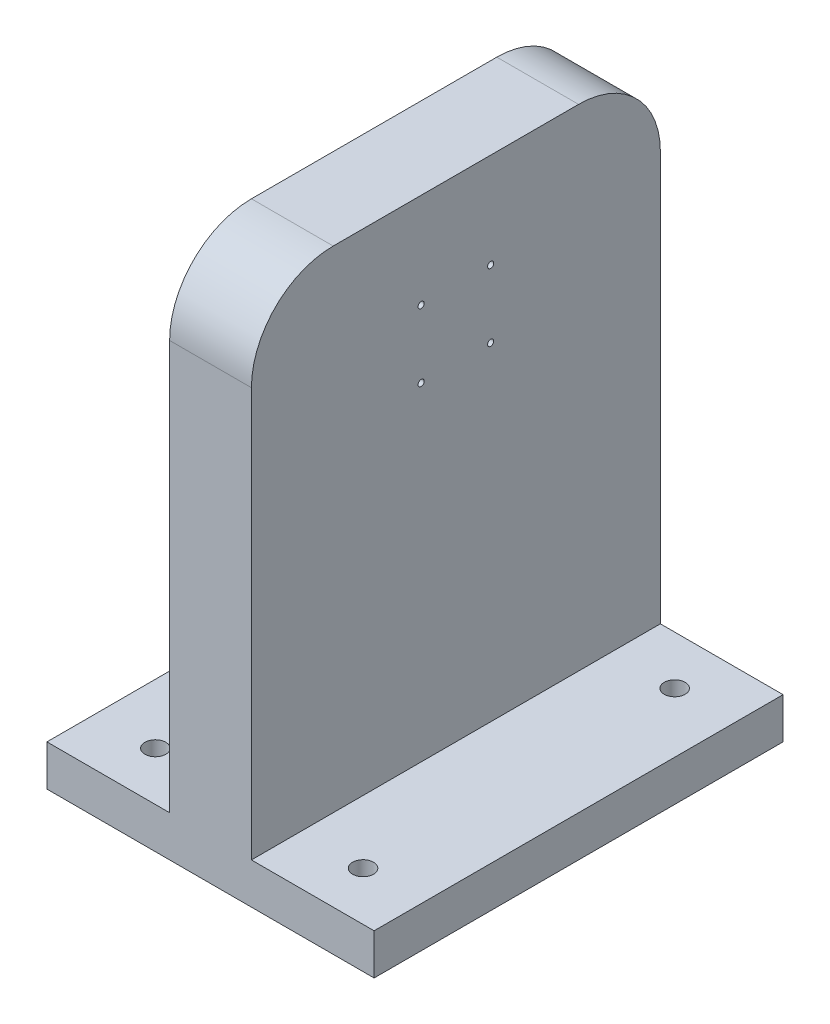
ISO-10303-21;
HEADER;
FILE_DESCRIPTION(('STEP AP214'),'2;1');
FILE_NAME('part.step','',(''),(''),'','','');
FILE_SCHEMA(('AUTOMOTIVE_DESIGN { 1 0 10303 214 1 1 1 1 }'));
ENDSEC;
DATA;
#1=APPLICATION_CONTEXT('core data for automotive mechanical design processes');
#2=APPLICATION_PROTOCOL_DEFINITION('international standard','automotive_design',2000,#1);
#3=PRODUCT_CONTEXT('',#1,'mechanical');
#4=PRODUCT('Part','Part','',(#3));
#5=PRODUCT_RELATED_PRODUCT_CATEGORY('part','',(#4));
#6=PRODUCT_DEFINITION_FORMATION('','',#4);
#7=PRODUCT_DEFINITION_CONTEXT('part definition',#1,'design');
#8=PRODUCT_DEFINITION('design','',#6,#7);
#9=PRODUCT_DEFINITION_SHAPE('','',#8);
#10=(LENGTH_UNIT() NAMED_UNIT(*) SI_UNIT(.MILLI.,.METRE.));
#11=(NAMED_UNIT(*) PLANE_ANGLE_UNIT() SI_UNIT($,.RADIAN.));
#12=(NAMED_UNIT(*) SI_UNIT($,.STERADIAN.) SOLID_ANGLE_UNIT());
#13=UNCERTAINTY_MEASURE_WITH_UNIT(LENGTH_MEASURE(1.E-05),#10,'distance_accuracy_value','');
#14=(GEOMETRIC_REPRESENTATION_CONTEXT(3) GLOBAL_UNCERTAINTY_ASSIGNED_CONTEXT((#13)) GLOBAL_UNIT_ASSIGNED_CONTEXT((#10,
#11,#12)) REPRESENTATION_CONTEXT('',''));
#15=CARTESIAN_POINT('',(0.,0.,0.));
#16=DIRECTION('',(0.,0.,1.));
#17=DIRECTION('',(1.,0.,0.));
#18=AXIS2_PLACEMENT_3D('',#15,#16,#17);
#19=CARTESIAN_POINT('',(10.,130.,50.));
#20=DIRECTION('',(-1.,0.,0.));
#21=DIRECTION('',(0.,0.,1.));
#22=AXIS2_PLACEMENT_3D('',#19,#20,#21);
#23=PLANE('',#22);
#24=CARTESIAN_POINT('',(10.,90.25,-8.49999999999999));
#25=DIRECTION('',(-1.,0.,0.));
#26=DIRECTION('',(0.,0.,1.));
#27=AXIS2_PLACEMENT_3D('',#24,#25,#26);
#28=CIRCLE('',#27,0.75);
#29=CARTESIAN_POINT('',(10.,90.25,-7.74999999999999));
#30=VERTEX_POINT('',#29);
#31=EDGE_CURVE('E444',#30,#30,#28,.T.);
#32=ORIENTED_EDGE('',*,*,#31,.T.);
#33=EDGE_LOOP('',(#32));
#34=FACE_BOUND('',#33,.T.);
#35=CARTESIAN_POINT('',(10.,106.75,-8.5));
#36=DIRECTION('',(-1.,0.,0.));
#37=DIRECTION('',(0.,0.,1.));
#38=AXIS2_PLACEMENT_3D('',#35,#36,#37);
#39=CIRCLE('',#38,0.75);
#40=CARTESIAN_POINT('',(10.,106.75,-7.75));
#41=VERTEX_POINT('',#40);
#42=EDGE_CURVE('E454',#41,#41,#39,.T.);
#43=ORIENTED_EDGE('',*,*,#42,.T.);
#44=EDGE_LOOP('',(#43));
#45=FACE_BOUND('',#44,.T.);
#46=DIRECTION('',(0.,-1.,0.));
#47=VECTOR('',#46,1.);
#48=CARTESIAN_POINT('',(10.,130.,-50.));
#49=LINE('',#48,#47);
#50=CARTESIAN_POINT('',(10.,110.,-50.));
#51=VERTEX_POINT('',#50);
#52=CARTESIAN_POINT('',(10.,10.,-50.));
#53=VERTEX_POINT('',#52);
#54=EDGE_CURVE('E156',#51,#53,#49,.T.);
#55=ORIENTED_EDGE('',*,*,#54,.F.);
#56=CARTESIAN_POINT('',(10.,110.,-30.));
#57=DIRECTION('',(-1.,0.,0.));
#58=DIRECTION('',(0.,0.,1.));
#59=AXIS2_PLACEMENT_3D('',#56,#57,#58);
#60=CIRCLE('',#59,20.);
#61=CARTESIAN_POINT('',(10.,130.,-30.));
#62=VERTEX_POINT('',#61);
#63=EDGE_CURVE('E47',#51,#62,#60,.F.);
#64=ORIENTED_EDGE('',*,*,#63,.T.);
#65=DIRECTION('',(0.,0.,-1.));
#66=VECTOR('',#65,1.);
#67=CARTESIAN_POINT('',(10.,130.,50.));
#68=LINE('',#67,#66);
#69=CARTESIAN_POINT('',(10.,130.,30.));
#70=VERTEX_POINT('',#69);
#71=EDGE_CURVE('E143',#70,#62,#68,.T.);
#72=ORIENTED_EDGE('',*,*,#71,.F.);
#73=CARTESIAN_POINT('',(10.,110.,30.));
#74=DIRECTION('',(-1.,0.,0.));
#75=DIRECTION('',(0.,0.,1.));
#76=AXIS2_PLACEMENT_3D('',#73,#74,#75);
#77=CIRCLE('',#76,20.);
#78=CARTESIAN_POINT('',(10.,110.,50.));
#79=VERTEX_POINT('',#78);
#80=EDGE_CURVE('E54',#70,#79,#77,.F.);
#81=ORIENTED_EDGE('',*,*,#80,.T.);
#82=DIRECTION('',(0.,-1.,0.));
#83=VECTOR('',#82,1.);
#84=CARTESIAN_POINT('',(10.,130.,50.));
#85=LINE('',#84,#83);
#86=CARTESIAN_POINT('',(10.,10.,50.));
#87=VERTEX_POINT('',#86);
#88=EDGE_CURVE('E126',#79,#87,#85,.T.);
#89=ORIENTED_EDGE('',*,*,#88,.T.);
#90=DIRECTION('',(0.,0.,-1.));
#91=VECTOR('',#90,1.);
#92=CARTESIAN_POINT('',(10.,10.,50.));
#93=LINE('',#92,#91);
#94=EDGE_CURVE('E144',#87,#53,#93,.T.);
#95=ORIENTED_EDGE('',*,*,#94,.T.);
#96=EDGE_LOOP('',(#55,#64,#72,#81,#89,#95));
#97=FACE_BOUND('',#96,.T.);
#98=CARTESIAN_POINT('',(10.,90.25,8.50000000000001));
#99=DIRECTION('',(-1.,0.,0.));
#100=DIRECTION('',(0.,0.,1.));
#101=AXIS2_PLACEMENT_3D('',#98,#99,#100);
#102=CIRCLE('',#101,0.750000000000014);
#103=CARTESIAN_POINT('',(10.,90.25,9.25000000000002));
#104=VERTEX_POINT('',#103);
#105=EDGE_CURVE('E451',#104,#104,#102,.F.);
#106=ORIENTED_EDGE('',*,*,#105,.F.);
#107=EDGE_LOOP('',(#106));
#108=FACE_BOUND('',#107,.T.);
#109=CARTESIAN_POINT('',(10.,106.75,8.5));
#110=DIRECTION('',(-1.,0.,0.));
#111=DIRECTION('',(0.,0.,1.));
#112=AXIS2_PLACEMENT_3D('',#109,#110,#111);
#113=CIRCLE('',#112,0.750000000000007);
#114=CARTESIAN_POINT('',(10.,106.75,9.25000000000001));
#115=VERTEX_POINT('',#114);
#116=EDGE_CURVE('E448',#115,#115,#113,.F.);
#117=ORIENTED_EDGE('',*,*,#116,.F.);
#118=EDGE_LOOP('',(#117));
#119=FACE_BOUND('',#118,.T.);
#120=ADVANCED_FACE('F39',(#34,#45,#97,#108,#119),#23,.F.);
#121=CARTESIAN_POINT('',(-10.,130.,50.));
#122=DIRECTION('',(1.,0.,0.));
#123=DIRECTION('',(0.,0.,-1.));
#124=AXIS2_PLACEMENT_3D('',#121,#122,#123);
#125=PLANE('',#124);
#126=CARTESIAN_POINT('',(-10.,90.25,-8.49999999999999));
#127=DIRECTION('',(-1.,0.,0.));
#128=DIRECTION('',(0.,0.,1.));
#129=AXIS2_PLACEMENT_3D('',#126,#127,#128);
#130=CIRCLE('',#129,0.75);
#131=CARTESIAN_POINT('',(-10.,90.25,-7.74999999999999));
#132=VERTEX_POINT('',#131);
#133=EDGE_CURVE('E461',#132,#132,#130,.T.);
#134=ORIENTED_EDGE('',*,*,#133,.F.);
#135=EDGE_LOOP('',(#134));
#136=FACE_BOUND('',#135,.T.);
#137=CARTESIAN_POINT('',(-10.,106.75,-8.5));
#138=DIRECTION('',(-1.,0.,0.));
#139=DIRECTION('',(0.,0.,1.));
#140=AXIS2_PLACEMENT_3D('',#137,#138,#139);
#141=CIRCLE('',#140,0.75);
#142=CARTESIAN_POINT('',(-10.,106.75,-7.75));
#143=VERTEX_POINT('',#142);
#144=EDGE_CURVE('E457',#143,#143,#141,.T.);
#145=ORIENTED_EDGE('',*,*,#144,.F.);
#146=EDGE_LOOP('',(#145));
#147=FACE_BOUND('',#146,.T.);
#148=DIRECTION('',(0.,0.,1.));
#149=VECTOR('',#148,1.);
#150=CARTESIAN_POINT('',(-10.,130.,50.));
#151=LINE('',#150,#149);
#152=CARTESIAN_POINT('',(-10.,130.,-30.));
#153=VERTEX_POINT('',#152);
#154=CARTESIAN_POINT('',(-10.,130.,30.));
#155=VERTEX_POINT('',#154);
#156=EDGE_CURVE('E147',#153,#155,#151,.T.);
#157=ORIENTED_EDGE('',*,*,#156,.F.);
#158=CARTESIAN_POINT('',(-10.,110.,-30.));
#159=DIRECTION('',(1.,0.,0.));
#160=DIRECTION('',(0.,0.,-1.));
#161=AXIS2_PLACEMENT_3D('',#158,#159,#160);
#162=CIRCLE('',#161,20.);
#163=CARTESIAN_POINT('',(-10.,110.,-50.));
#164=VERTEX_POINT('',#163);
#165=EDGE_CURVE('E193',#153,#164,#162,.F.);
#166=ORIENTED_EDGE('',*,*,#165,.T.);
#167=DIRECTION('',(0.,-1.,0.));
#168=VECTOR('',#167,1.);
#169=CARTESIAN_POINT('',(-10.,130.,-50.));
#170=LINE('',#169,#168);
#171=CARTESIAN_POINT('',(-10.,10.,-50.));
#172=VERTEX_POINT('',#171);
#173=EDGE_CURVE('E125',#164,#172,#170,.T.);
#174=ORIENTED_EDGE('',*,*,#173,.T.);
#175=DIRECTION('',(0.,0.,1.));
#176=VECTOR('',#175,1.);
#177=CARTESIAN_POINT('',(-10.,10.,50.));
#178=LINE('',#177,#176);
#179=CARTESIAN_POINT('',(-10.,10.,50.));
#180=VERTEX_POINT('',#179);
#181=EDGE_CURVE('E133',#172,#180,#178,.T.);
#182=ORIENTED_EDGE('',*,*,#181,.T.);
#183=DIRECTION('',(0.,-1.,0.));
#184=VECTOR('',#183,1.);
#185=CARTESIAN_POINT('',(-10.,130.,50.));
#186=LINE('',#185,#184);
#187=CARTESIAN_POINT('',(-10.,110.,50.));
#188=VERTEX_POINT('',#187);
#189=EDGE_CURVE('E116',#188,#180,#186,.T.);
#190=ORIENTED_EDGE('',*,*,#189,.F.);
#191=CARTESIAN_POINT('',(-10.,110.,30.));
#192=DIRECTION('',(1.,0.,0.));
#193=DIRECTION('',(0.,0.,-1.));
#194=AXIS2_PLACEMENT_3D('',#191,#192,#193);
#195=CIRCLE('',#194,20.);
#196=EDGE_CURVE('E191',#188,#155,#195,.F.);
#197=ORIENTED_EDGE('',*,*,#196,.T.);
#198=EDGE_LOOP('',(#157,#166,#174,#182,#190,#197));
#199=FACE_BOUND('',#198,.T.);
#200=CARTESIAN_POINT('',(-10.,90.25,8.50000000000001));
#201=DIRECTION('',(1.,0.,0.));
#202=DIRECTION('',(0.,0.,-1.));
#203=AXIS2_PLACEMENT_3D('',#200,#201,#202);
#204=CIRCLE('',#203,0.750000000000014);
#205=CARTESIAN_POINT('',(-10.,90.25,7.74999999999999));
#206=VERTEX_POINT('',#205);
#207=EDGE_CURVE('E460',#206,#206,#204,.T.);
#208=ORIENTED_EDGE('',*,*,#207,.T.);
#209=EDGE_LOOP('',(#208));
#210=FACE_BOUND('',#209,.T.);
#211=CARTESIAN_POINT('',(-10.,106.75,8.5));
#212=DIRECTION('',(1.,0.,0.));
#213=DIRECTION('',(0.,0.,-1.));
#214=AXIS2_PLACEMENT_3D('',#211,#212,#213);
#215=CIRCLE('',#214,0.750000000000007);
#216=CARTESIAN_POINT('',(-10.,106.75,7.75));
#217=VERTEX_POINT('',#216);
#218=EDGE_CURVE('E463',#217,#217,#215,.T.);
#219=ORIENTED_EDGE('',*,*,#218,.T.);
#220=EDGE_LOOP('',(#219));
#221=FACE_BOUND('',#220,.T.);
#222=ADVANCED_FACE('F141',(#136,#147,#199,#210,#221),#125,.F.);
#223=CARTESIAN_POINT('',(0.,10.,0.));
#224=DIRECTION('',(0.,1.,0.));
#225=DIRECTION('',(0.,0.,1.));
#226=AXIS2_PLACEMENT_3D('',#223,#224,#225);
#227=PLANE('',#226);
#228=CARTESIAN_POINT('',(25.4,10.,-38.1));
#229=DIRECTION('',(0.,1.,0.));
#230=DIRECTION('',(0.,0.,1.));
#231=AXIS2_PLACEMENT_3D('',#228,#229,#230);
#232=CIRCLE('',#231,2.555);
#233=CARTESIAN_POINT('',(25.4,10.,-35.545));
#234=VERTEX_POINT('',#233);
#235=EDGE_CURVE('E231',#234,#234,#232,.F.);
#236=ORIENTED_EDGE('',*,*,#235,.T.);
#237=EDGE_LOOP('',(#236));
#238=FACE_BOUND('',#237,.T.);
#239=ORIENTED_EDGE('',*,*,#94,.F.);
#240=DIRECTION('',(1.,0.,0.));
#241=VECTOR('',#240,1.);
#242=CARTESIAN_POINT('',(-40.,10.,50.));
#243=LINE('',#242,#241);
#244=CARTESIAN_POINT('',(40.,10.,50.));
#245=VERTEX_POINT('',#244);
#246=EDGE_CURVE('E138',#87,#245,#243,.T.);
#247=ORIENTED_EDGE('',*,*,#246,.T.);
#248=DIRECTION('',(0.,0.,-1.));
#249=VECTOR('',#248,1.);
#250=CARTESIAN_POINT('',(40.,10.,50.));
#251=LINE('',#250,#249);
#252=CARTESIAN_POINT('',(40.,10.,-50.));
#253=VERTEX_POINT('',#252);
#254=EDGE_CURVE('E137',#245,#253,#251,.T.);
#255=ORIENTED_EDGE('',*,*,#254,.T.);
#256=DIRECTION('',(1.,0.,0.));
#257=VECTOR('',#256,1.);
#258=CARTESIAN_POINT('',(-40.,10.,-50.));
#259=LINE('',#258,#257);
#260=EDGE_CURVE('E161',#53,#253,#259,.T.);
#261=ORIENTED_EDGE('',*,*,#260,.F.);
#262=EDGE_LOOP('',(#239,#247,#255,#261));
#263=FACE_BOUND('',#262,.T.);
#264=CARTESIAN_POINT('',(25.4,10.,38.1));
#265=DIRECTION('',(0.,1.,0.));
#266=DIRECTION('',(0.,0.,1.));
#267=AXIS2_PLACEMENT_3D('',#264,#265,#266);
#268=CIRCLE('',#267,2.555);
#269=CARTESIAN_POINT('',(25.4,10.,40.655));
#270=VERTEX_POINT('',#269);
#271=EDGE_CURVE('E150',#270,#270,#268,.T.);
#272=ORIENTED_EDGE('',*,*,#271,.F.);
#273=EDGE_LOOP('',(#272));
#274=FACE_BOUND('',#273,.T.);
#275=ADVANCED_FACE('F222',(#238,#263,#274),#227,.T.);
#276=CARTESIAN_POINT('',(-25.4,10.,38.1));
#277=DIRECTION('',(0.,1.,0.));
#278=DIRECTION('',(0.,0.,1.));
#279=AXIS2_PLACEMENT_3D('',#276,#277,#278);
#280=CIRCLE('',#279,2.555);
#281=CARTESIAN_POINT('',(-25.4,10.,40.655));
#282=VERTEX_POINT('',#281);
#283=EDGE_CURVE('E370',#282,#282,#280,.F.);
#284=ORIENTED_EDGE('',*,*,#283,.T.);
#285=EDGE_LOOP('',(#284));
#286=FACE_BOUND('',#285,.T.);
#287=ORIENTED_EDGE('',*,*,#181,.F.);
#288=CARTESIAN_POINT('',(-40.,10.,-50.));
#289=VERTEX_POINT('',#288);
#290=EDGE_CURVE('E162',#289,#172,#259,.T.);
#291=ORIENTED_EDGE('',*,*,#290,.F.);
#292=DIRECTION('',(0.,0.,-1.));
#293=VECTOR('',#292,1.);
#294=CARTESIAN_POINT('',(-40.,10.,50.));
#295=LINE('',#294,#293);
#296=CARTESIAN_POINT('',(-40.,10.,50.));
#297=VERTEX_POINT('',#296);
#298=EDGE_CURVE('E136',#297,#289,#295,.T.);
#299=ORIENTED_EDGE('',*,*,#298,.F.);
#300=EDGE_CURVE('E119',#297,#180,#243,.T.);
#301=ORIENTED_EDGE('',*,*,#300,.T.);
#302=EDGE_LOOP('',(#287,#291,#299,#301));
#303=FACE_BOUND('',#302,.T.);
#304=CARTESIAN_POINT('',(-25.4,10.,-38.1));
#305=DIRECTION('',(0.,1.,0.));
#306=DIRECTION('',(0.,0.,1.));
#307=AXIS2_PLACEMENT_3D('',#304,#305,#306);
#308=CIRCLE('',#307,2.555);
#309=CARTESIAN_POINT('',(-25.4,10.,-35.545));
#310=VERTEX_POINT('',#309);
#311=EDGE_CURVE('E234',#310,#310,#308,.T.);
#312=ORIENTED_EDGE('',*,*,#311,.F.);
#313=EDGE_LOOP('',(#312));
#314=FACE_BOUND('',#313,.T.);
#315=ADVANCED_FACE('F130',(#286,#303,#314),#227,.T.);
#316=CARTESIAN_POINT('',(0.,0.,0.));
#317=DIRECTION('',(0.,1.,0.));
#318=DIRECTION('',(0.,0.,1.));
#319=AXIS2_PLACEMENT_3D('',#316,#317,#318);
#320=PLANE('',#319);
#321=CARTESIAN_POINT('',(-25.4,0.,-38.1));
#322=DIRECTION('',(0.,-1.,0.));
#323=DIRECTION('',(0.,0.,-1.));
#324=AXIS2_PLACEMENT_3D('',#321,#322,#323);
#325=CIRCLE('',#324,2.555);
#326=CARTESIAN_POINT('',(-25.4,0.,-40.655));
#327=VERTEX_POINT('',#326);
#328=EDGE_CURVE('E375',#327,#327,#325,.T.);
#329=ORIENTED_EDGE('',*,*,#328,.F.);
#330=EDGE_LOOP('',(#329));
#331=FACE_BOUND('',#330,.T.);
#332=CARTESIAN_POINT('',(-25.4,0.,38.1));
#333=DIRECTION('',(0.,1.,0.));
#334=DIRECTION('',(0.,0.,1.));
#335=AXIS2_PLACEMENT_3D('',#332,#333,#334);
#336=CIRCLE('',#335,2.555);
#337=CARTESIAN_POINT('',(-25.4,0.,40.655));
#338=VERTEX_POINT('',#337);
#339=EDGE_CURVE('E373',#338,#338,#336,.T.);
#340=ORIENTED_EDGE('',*,*,#339,.T.);
#341=EDGE_LOOP('',(#340));
#342=FACE_BOUND('',#341,.T.);
#343=DIRECTION('',(1.,0.,0.));
#344=VECTOR('',#343,1.);
#345=CARTESIAN_POINT('',(-40.,0.,50.));
#346=LINE('',#345,#344);
#347=CARTESIAN_POINT('',(-40.,0.,50.));
#348=VERTEX_POINT('',#347);
#349=CARTESIAN_POINT('',(40.,0.,50.));
#350=VERTEX_POINT('',#349);
#351=EDGE_CURVE('E157',#348,#350,#346,.T.);
#352=ORIENTED_EDGE('',*,*,#351,.F.);
#353=DIRECTION('',(0.,0.,-1.));
#354=VECTOR('',#353,1.);
#355=CARTESIAN_POINT('',(-40.,0.,50.));
#356=LINE('',#355,#354);
#357=CARTESIAN_POINT('',(-40.,0.,-50.));
#358=VERTEX_POINT('',#357);
#359=EDGE_CURVE('E174',#348,#358,#356,.T.);
#360=ORIENTED_EDGE('',*,*,#359,.T.);
#361=DIRECTION('',(1.,0.,0.));
#362=VECTOR('',#361,1.);
#363=CARTESIAN_POINT('',(-40.,0.,-50.));
#364=LINE('',#363,#362);
#365=CARTESIAN_POINT('',(40.,0.,-50.));
#366=VERTEX_POINT('',#365);
#367=EDGE_CURVE('E171',#358,#366,#364,.T.);
#368=ORIENTED_EDGE('',*,*,#367,.T.);
#369=DIRECTION('',(0.,0.,-1.));
#370=VECTOR('',#369,1.);
#371=CARTESIAN_POINT('',(40.,0.,50.));
#372=LINE('',#371,#370);
#373=EDGE_CURVE('E168',#350,#366,#372,.T.);
#374=ORIENTED_EDGE('',*,*,#373,.F.);
#375=EDGE_LOOP('',(#352,#360,#368,#374));
#376=FACE_BOUND('',#375,.T.);
#377=CARTESIAN_POINT('',(25.4,0.,-38.1));
#378=DIRECTION('',(0.,1.,0.));
#379=DIRECTION('',(0.,0.,1.));
#380=AXIS2_PLACEMENT_3D('',#377,#378,#379);
#381=CIRCLE('',#380,2.555);
#382=CARTESIAN_POINT('',(25.4,0.,-35.545));
#383=VERTEX_POINT('',#382);
#384=EDGE_CURVE('E379',#383,#383,#381,.T.);
#385=ORIENTED_EDGE('',*,*,#384,.T.);
#386=EDGE_LOOP('',(#385));
#387=FACE_BOUND('',#386,.T.);
#388=CARTESIAN_POINT('',(25.4,0.,38.1));
#389=DIRECTION('',(0.,-1.,0.));
#390=DIRECTION('',(0.,0.,-1.));
#391=AXIS2_PLACEMENT_3D('',#388,#389,#390);
#392=CIRCLE('',#391,2.555);
#393=CARTESIAN_POINT('',(25.4,0.,35.545));
#394=VERTEX_POINT('',#393);
#395=EDGE_CURVE('E382',#394,#394,#392,.T.);
#396=ORIENTED_EDGE('',*,*,#395,.F.);
#397=EDGE_LOOP('',(#396));
#398=FACE_BOUND('',#397,.T.);
#399=ADVANCED_FACE('F213',(#331,#342,#376,#387,#398),#320,.F.);
#400=CARTESIAN_POINT('',(-40.,10.,50.));
#401=DIRECTION('',(0.,0.,-1.));
#402=DIRECTION('',(-1.,0.,0.));
#403=AXIS2_PLACEMENT_3D('',#400,#401,#402);
#404=PLANE('',#403);
#405=ORIENTED_EDGE('',*,*,#88,.F.);
#406=DIRECTION('',(1.,0.,0.));
#407=VECTOR('',#406,1.);
#408=CARTESIAN_POINT('',(-40.,110.,50.));
#409=LINE('',#408,#407);
#410=EDGE_CURVE('E11',#79,#188,#409,.F.);
#411=ORIENTED_EDGE('',*,*,#410,.T.);
#412=ORIENTED_EDGE('',*,*,#189,.T.);
#413=ORIENTED_EDGE('',*,*,#300,.F.);
#414=DIRECTION('',(0.,-1.,0.));
#415=VECTOR('',#414,1.);
#416=CARTESIAN_POINT('',(-40.,10.,50.));
#417=LINE('',#416,#415);
#418=EDGE_CURVE('E165',#297,#348,#417,.T.);
#419=ORIENTED_EDGE('',*,*,#418,.T.);
#420=ORIENTED_EDGE('',*,*,#351,.T.);
#421=DIRECTION('',(0.,-1.,0.));
#422=VECTOR('',#421,1.);
#423=CARTESIAN_POINT('',(40.,10.,50.));
#424=LINE('',#423,#422);
#425=EDGE_CURVE('E182',#245,#350,#424,.T.);
#426=ORIENTED_EDGE('',*,*,#425,.F.);
#427=ORIENTED_EDGE('',*,*,#246,.F.);
#428=EDGE_LOOP('',(#405,#411,#412,#413,#419,#420,#426,#427));
#429=FACE_BOUND('',#428,.T.);
#430=ADVANCED_FACE('F118',(#429),#404,.F.);
#431=CARTESIAN_POINT('',(40.,10.,50.));
#432=DIRECTION('',(-1.,0.,0.));
#433=DIRECTION('',(0.,0.,1.));
#434=AXIS2_PLACEMENT_3D('',#431,#432,#433);
#435=PLANE('',#434);
#436=ORIENTED_EDGE('',*,*,#373,.T.);
#437=DIRECTION('',(0.,-1.,0.));
#438=VECTOR('',#437,1.);
#439=CARTESIAN_POINT('',(40.,10.,-50.));
#440=LINE('',#439,#438);
#441=EDGE_CURVE('E180',#253,#366,#440,.T.);
#442=ORIENTED_EDGE('',*,*,#441,.F.);
#443=ORIENTED_EDGE('',*,*,#254,.F.);
#444=ORIENTED_EDGE('',*,*,#425,.T.);
#445=EDGE_LOOP('',(#436,#442,#443,#444));
#446=FACE_BOUND('',#445,.T.);
#447=ADVANCED_FACE('F218',(#446),#435,.F.);
#448=CARTESIAN_POINT('',(-40.,10.,-50.));
#449=DIRECTION('',(0.,0.,-1.));
#450=DIRECTION('',(-1.,0.,0.));
#451=AXIS2_PLACEMENT_3D('',#448,#449,#450);
#452=PLANE('',#451);
#453=ORIENTED_EDGE('',*,*,#173,.F.);
#454=DIRECTION('',(-1.,0.,0.));
#455=VECTOR('',#454,1.);
#456=CARTESIAN_POINT('',(10.,110.,-50.));
#457=LINE('',#456,#455);
#458=EDGE_CURVE('E62',#164,#51,#457,.F.);
#459=ORIENTED_EDGE('',*,*,#458,.T.);
#460=ORIENTED_EDGE('',*,*,#54,.T.);
#461=ORIENTED_EDGE('',*,*,#260,.T.);
#462=ORIENTED_EDGE('',*,*,#441,.T.);
#463=ORIENTED_EDGE('',*,*,#367,.F.);
#464=DIRECTION('',(0.,-1.,0.));
#465=VECTOR('',#464,1.);
#466=CARTESIAN_POINT('',(-40.,10.,-50.));
#467=LINE('',#466,#465);
#468=EDGE_CURVE('E178',#289,#358,#467,.T.);
#469=ORIENTED_EDGE('',*,*,#468,.F.);
#470=ORIENTED_EDGE('',*,*,#290,.T.);
#471=EDGE_LOOP('',(#453,#459,#460,#461,#462,#463,#469,#470));
#472=FACE_BOUND('',#471,.T.);
#473=ADVANCED_FACE('F205',(#472),#452,.T.);
#474=CARTESIAN_POINT('',(-40.,10.,50.));
#475=DIRECTION('',(-1.,0.,0.));
#476=DIRECTION('',(0.,0.,1.));
#477=AXIS2_PLACEMENT_3D('',#474,#475,#476);
#478=PLANE('',#477);
#479=ORIENTED_EDGE('',*,*,#359,.F.);
#480=ORIENTED_EDGE('',*,*,#418,.F.);
#481=ORIENTED_EDGE('',*,*,#298,.T.);
#482=ORIENTED_EDGE('',*,*,#468,.T.);
#483=EDGE_LOOP('',(#479,#480,#481,#482));
#484=FACE_BOUND('',#483,.T.);
#485=ADVANCED_FACE('F209',(#484),#478,.T.);
#486=CARTESIAN_POINT('',(0.,130.,0.));
#487=DIRECTION('',(0.,-1.,0.));
#488=DIRECTION('',(0.,0.,-1.));
#489=AXIS2_PLACEMENT_3D('',#486,#487,#488);
#490=PLANE('',#489);
#491=ORIENTED_EDGE('',*,*,#71,.T.);
#492=DIRECTION('',(-1.,0.,0.));
#493=VECTOR('',#492,1.);
#494=CARTESIAN_POINT('',(-10.,130.,-30.));
#495=LINE('',#494,#493);
#496=EDGE_CURVE('E188',#62,#153,#495,.T.);
#497=ORIENTED_EDGE('',*,*,#496,.T.);
#498=ORIENTED_EDGE('',*,*,#156,.T.);
#499=DIRECTION('',(1.,0.,0.));
#500=VECTOR('',#499,1.);
#501=CARTESIAN_POINT('',(0.,130.,30.));
#502=LINE('',#501,#500);
#503=EDGE_CURVE('E185',#155,#70,#502,.T.);
#504=ORIENTED_EDGE('',*,*,#503,.T.);
#505=EDGE_LOOP('',(#491,#497,#498,#504));
#506=FACE_BOUND('',#505,.T.);
#507=ADVANCED_FACE('F201',(#506),#490,.F.);
#508=CARTESIAN_POINT('',(-25.4,55.,38.1));
#509=DIRECTION('',(0.,-1.,0.));
#510=DIRECTION('',(0.,0.,-1.));
#511=AXIS2_PLACEMENT_3D('',#508,#509,#510);
#512=CYLINDRICAL_SURFACE('',#511,2.555);
#513=ORIENTED_EDGE('',*,*,#283,.F.);
#514=EDGE_LOOP('',(#513));
#515=FACE_BOUND('',#514,.T.);
#516=ORIENTED_EDGE('',*,*,#339,.F.);
#517=EDGE_LOOP('',(#516));
#518=FACE_BOUND('',#517,.T.);
#519=ADVANCED_FACE('F288',(#515,#518),#512,.F.);
#520=CARTESIAN_POINT('',(-25.4,55.,-38.1));
#521=DIRECTION('',(0.,-1.,0.));
#522=DIRECTION('',(0.,0.,-1.));
#523=AXIS2_PLACEMENT_3D('',#520,#521,#522);
#524=CYLINDRICAL_SURFACE('',#523,2.555);
#525=ORIENTED_EDGE('',*,*,#311,.T.);
#526=EDGE_LOOP('',(#525));
#527=FACE_BOUND('',#526,.T.);
#528=ORIENTED_EDGE('',*,*,#328,.T.);
#529=EDGE_LOOP('',(#528));
#530=FACE_BOUND('',#529,.T.);
#531=ADVANCED_FACE('F355',(#527,#530),#524,.F.);
#532=CARTESIAN_POINT('',(25.4,55.,-38.1));
#533=DIRECTION('',(0.,-1.,0.));
#534=DIRECTION('',(0.,0.,-1.));
#535=AXIS2_PLACEMENT_3D('',#532,#533,#534);
#536=CYLINDRICAL_SURFACE('',#535,2.555);
#537=ORIENTED_EDGE('',*,*,#235,.F.);
#538=EDGE_LOOP('',(#537));
#539=FACE_BOUND('',#538,.T.);
#540=ORIENTED_EDGE('',*,*,#384,.F.);
#541=EDGE_LOOP('',(#540));
#542=FACE_BOUND('',#541,.T.);
#543=ADVANCED_FACE('F358',(#539,#542),#536,.F.);
#544=CARTESIAN_POINT('',(25.4,55.,38.1));
#545=DIRECTION('',(0.,-1.,0.));
#546=DIRECTION('',(0.,0.,-1.));
#547=AXIS2_PLACEMENT_3D('',#544,#545,#546);
#548=CYLINDRICAL_SURFACE('',#547,2.555);
#549=ORIENTED_EDGE('',*,*,#271,.T.);
#550=EDGE_LOOP('',(#549));
#551=FACE_BOUND('',#550,.T.);
#552=ORIENTED_EDGE('',*,*,#395,.T.);
#553=EDGE_LOOP('',(#552));
#554=FACE_BOUND('',#553,.T.);
#555=ADVANCED_FACE('F248',(#551,#554),#548,.F.);
#556=CARTESIAN_POINT('',(0.,110.,-30.));
#557=DIRECTION('',(1.,0.,0.));
#558=DIRECTION('',(0.,0.,-1.));
#559=AXIS2_PLACEMENT_3D('',#556,#557,#558);
#560=CYLINDRICAL_SURFACE('',#559,20.);
#561=ORIENTED_EDGE('',*,*,#63,.F.);
#562=ORIENTED_EDGE('',*,*,#458,.F.);
#563=ORIENTED_EDGE('',*,*,#165,.F.);
#564=ORIENTED_EDGE('',*,*,#496,.F.);
#565=EDGE_LOOP('',(#561,#562,#563,#564));
#566=FACE_BOUND('',#565,.T.);
#567=ADVANCED_FACE('F204',(#566),#560,.T.);
#568=CARTESIAN_POINT('',(0.,110.,30.));
#569=DIRECTION('',(1.,0.,0.));
#570=DIRECTION('',(0.,0.,-1.));
#571=AXIS2_PLACEMENT_3D('',#568,#569,#570);
#572=CYLINDRICAL_SURFACE('',#571,20.);
#573=ORIENTED_EDGE('',*,*,#196,.F.);
#574=ORIENTED_EDGE('',*,*,#410,.F.);
#575=ORIENTED_EDGE('',*,*,#80,.F.);
#576=ORIENTED_EDGE('',*,*,#503,.F.);
#577=EDGE_LOOP('',(#573,#574,#575,#576));
#578=FACE_BOUND('',#577,.T.);
#579=ADVANCED_FACE('F41',(#578),#572,.T.);
#580=CARTESIAN_POINT('',(40.,106.75,-8.5));
#581=DIRECTION('',(-1.,0.,0.));
#582=DIRECTION('',(0.,0.,1.));
#583=AXIS2_PLACEMENT_3D('',#580,#581,#582);
#584=CYLINDRICAL_SURFACE('',#583,0.75);
#585=ORIENTED_EDGE('',*,*,#144,.T.);
#586=EDGE_LOOP('',(#585));
#587=FACE_BOUND('',#586,.T.);
#588=ORIENTED_EDGE('',*,*,#42,.F.);
#589=EDGE_LOOP('',(#588));
#590=FACE_BOUND('',#589,.T.);
#591=ADVANCED_FACE('F239',(#587,#590),#584,.F.);
#592=CARTESIAN_POINT('',(40.,90.25,8.50000000000001));
#593=DIRECTION('',(-1.,0.,0.));
#594=DIRECTION('',(0.,0.,1.));
#595=AXIS2_PLACEMENT_3D('',#592,#593,#594);
#596=CYLINDRICAL_SURFACE('',#595,0.750000000000014);
#597=ORIENTED_EDGE('',*,*,#207,.F.);
#598=EDGE_LOOP('',(#597));
#599=FACE_BOUND('',#598,.T.);
#600=ORIENTED_EDGE('',*,*,#105,.T.);
#601=EDGE_LOOP('',(#600));
#602=FACE_BOUND('',#601,.T.);
#603=ADVANCED_FACE('F245',(#599,#602),#596,.F.);
#604=CARTESIAN_POINT('',(40.,106.75,8.5));
#605=DIRECTION('',(-1.,0.,0.));
#606=DIRECTION('',(0.,0.,1.));
#607=AXIS2_PLACEMENT_3D('',#604,#605,#606);
#608=CYLINDRICAL_SURFACE('',#607,0.750000000000007);
#609=ORIENTED_EDGE('',*,*,#218,.F.);
#610=EDGE_LOOP('',(#609));
#611=FACE_BOUND('',#610,.T.);
#612=ORIENTED_EDGE('',*,*,#116,.T.);
#613=EDGE_LOOP('',(#612));
#614=FACE_BOUND('',#613,.T.);
#615=ADVANCED_FACE('F329',(#611,#614),#608,.F.);
#616=CARTESIAN_POINT('',(40.,90.25,-8.49999999999999));
#617=DIRECTION('',(-1.,0.,0.));
#618=DIRECTION('',(0.,0.,1.));
#619=AXIS2_PLACEMENT_3D('',#616,#617,#618);
#620=CYLINDRICAL_SURFACE('',#619,0.75);
#621=ORIENTED_EDGE('',*,*,#133,.T.);
#622=EDGE_LOOP('',(#621));
#623=FACE_BOUND('',#622,.T.);
#624=ORIENTED_EDGE('',*,*,#31,.F.);
#625=EDGE_LOOP('',(#624));
#626=FACE_BOUND('',#625,.T.);
#627=ADVANCED_FACE('F339',(#623,#626),#620,.F.);
#628=CLOSED_SHELL('',(#120,#222,#275,#315,#399,#430,#447,#473,#485,#507,#519,#531,#543,#555,
#567,#579,#591,#603,#615,#627));
#629=MANIFOLD_SOLID_BREP('B2',#628);
#630=ADVANCED_BREP_SHAPE_REPRESENTATION('',(#18,#629),#14);
#631=SHAPE_DEFINITION_REPRESENTATION(#9,#630);
ENDSEC;
END-ISO-10303-21;
